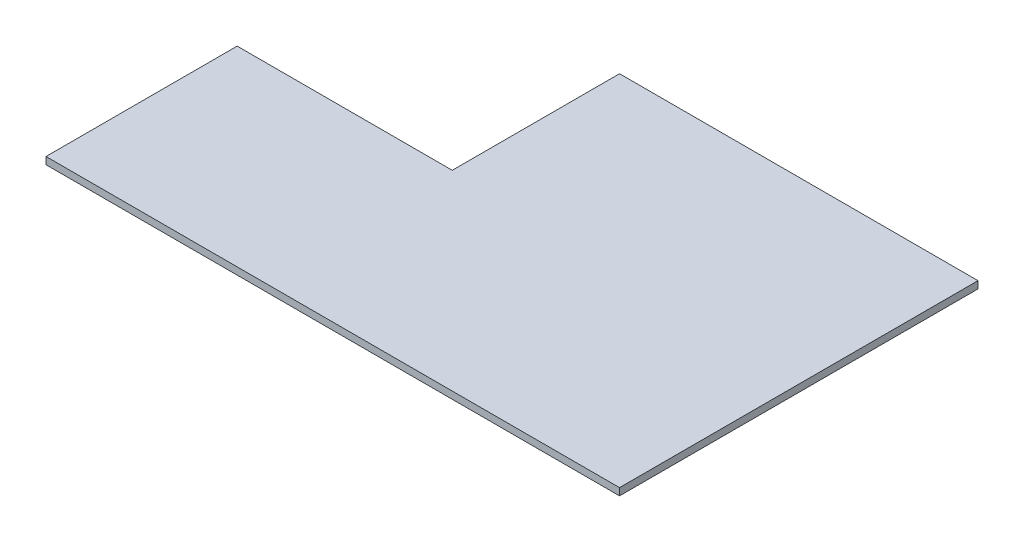
ISO-10303-21;
HEADER;
FILE_DESCRIPTION(('STEP AP214'),'2;1');
FILE_NAME('part.step','',(''),(''),'','','');
FILE_SCHEMA(('AUTOMOTIVE_DESIGN { 1 0 10303 214 1 1 1 1 }'));
ENDSEC;
DATA;
#1=APPLICATION_CONTEXT('core data for automotive mechanical design processes');
#2=APPLICATION_PROTOCOL_DEFINITION('international standard','automotive_design',2000,#1);
#3=PRODUCT_CONTEXT('',#1,'mechanical');
#4=PRODUCT('Part','Part','',(#3));
#5=PRODUCT_RELATED_PRODUCT_CATEGORY('part','',(#4));
#6=PRODUCT_DEFINITION_FORMATION('','',#4);
#7=PRODUCT_DEFINITION_CONTEXT('part definition',#1,'design');
#8=PRODUCT_DEFINITION('design','',#6,#7);
#9=PRODUCT_DEFINITION_SHAPE('','',#8);
#10=(LENGTH_UNIT() NAMED_UNIT(*) SI_UNIT(.MILLI.,.METRE.));
#11=(NAMED_UNIT(*) PLANE_ANGLE_UNIT() SI_UNIT($,.RADIAN.));
#12=(NAMED_UNIT(*) SI_UNIT($,.STERADIAN.) SOLID_ANGLE_UNIT());
#13=UNCERTAINTY_MEASURE_WITH_UNIT(LENGTH_MEASURE(1.E-05),#10,'distance_accuracy_value','');
#14=(GEOMETRIC_REPRESENTATION_CONTEXT(3) GLOBAL_UNCERTAINTY_ASSIGNED_CONTEXT((#13)) GLOBAL_UNIT_ASSIGNED_CONTEXT((#10,
#11,#12)) REPRESENTATION_CONTEXT('',''));
#15=CARTESIAN_POINT('',(0.,0.,0.));
#16=DIRECTION('',(0.,0.,1.));
#17=DIRECTION('',(1.,0.,0.));
#18=AXIS2_PLACEMENT_3D('',#15,#16,#17);
#19=CARTESIAN_POINT('',(-120.,3.,17.9310344827586));
#20=DIRECTION('',(0.,0.,-1.));
#21=DIRECTION('',(-1.,0.,0.));
#22=AXIS2_PLACEMENT_3D('',#19,#20,#21);
#23=PLANE('',#22);
#24=DIRECTION('',(1.,0.,0.));
#25=VECTOR('',#24,1.);
#26=CARTESIAN_POINT('',(-120.,0.,17.9310344827586));
#27=LINE('',#26,#25);
#28=CARTESIAN_POINT('',(-120.,0.,17.9310344827586));
#29=VERTEX_POINT('',#28);
#30=CARTESIAN_POINT('',(120.,0.,17.9310344827586));
#31=VERTEX_POINT('',#30);
#32=EDGE_CURVE('E119',#29,#31,#27,.T.);
#33=ORIENTED_EDGE('',*,*,#32,.T.);
#34=DIRECTION('',(0.,-1.,0.));
#35=VECTOR('',#34,1.);
#36=CARTESIAN_POINT('',(120.,3.,17.9310344827586));
#37=LINE('',#36,#35);
#38=CARTESIAN_POINT('',(120.,3.,17.9310344827586));
#39=VERTEX_POINT('',#38);
#40=EDGE_CURVE('E11',#39,#31,#37,.T.);
#41=ORIENTED_EDGE('',*,*,#40,.F.);
#42=DIRECTION('',(1.,0.,0.));
#43=VECTOR('',#42,1.);
#44=CARTESIAN_POINT('',(-120.,3.,17.9310344827586));
#45=LINE('',#44,#43);
#46=CARTESIAN_POINT('',(-120.,3.,17.9310344827586));
#47=VERTEX_POINT('',#46);
#48=EDGE_CURVE('E129',#47,#39,#45,.T.);
#49=ORIENTED_EDGE('',*,*,#48,.F.);
#50=DIRECTION('',(0.,-1.,0.));
#51=VECTOR('',#50,1.);
#52=CARTESIAN_POINT('',(-120.,3.,17.9310344827586));
#53=LINE('',#52,#51);
#54=EDGE_CURVE('E115',#47,#29,#53,.T.);
#55=ORIENTED_EDGE('',*,*,#54,.T.);
#56=EDGE_LOOP('',(#33,#41,#49,#55));
#57=FACE_BOUND('',#56,.T.);
#58=ADVANCED_FACE('F35',(#57),#23,.F.);
#59=CARTESIAN_POINT('',(120.,3.,-132.068965517241));
#60=DIRECTION('',(-1.,0.,0.));
#61=DIRECTION('',(0.,0.,1.));
#62=AXIS2_PLACEMENT_3D('',#59,#60,#61);
#63=PLANE('',#62);
#64=DIRECTION('',(0.,0.,-1.));
#65=VECTOR('',#64,1.);
#66=CARTESIAN_POINT('',(120.,0.,-132.068965517241));
#67=LINE('',#66,#65);
#68=CARTESIAN_POINT('',(120.,0.,-132.068965517241));
#69=VERTEX_POINT('',#68);
#70=EDGE_CURVE('E122',#31,#69,#67,.T.);
#71=ORIENTED_EDGE('',*,*,#70,.T.);
#72=DIRECTION('',(0.,-1.,0.));
#73=VECTOR('',#72,1.);
#74=CARTESIAN_POINT('',(120.,3.,-132.068965517241));
#75=LINE('',#74,#73);
#76=CARTESIAN_POINT('',(120.,3.,-132.068965517241));
#77=VERTEX_POINT('',#76);
#78=EDGE_CURVE('E43',#77,#69,#75,.T.);
#79=ORIENTED_EDGE('',*,*,#78,.F.);
#80=DIRECTION('',(0.,0.,-1.));
#81=VECTOR('',#80,1.);
#82=CARTESIAN_POINT('',(120.,3.,-132.068965517241));
#83=LINE('',#82,#81);
#84=EDGE_CURVE('E88',#39,#77,#83,.T.);
#85=ORIENTED_EDGE('',*,*,#84,.F.);
#86=ORIENTED_EDGE('',*,*,#40,.T.);
#87=EDGE_LOOP('',(#71,#79,#85,#86));
#88=FACE_BOUND('',#87,.T.);
#89=ADVANCED_FACE('F153',(#88),#63,.F.);
#90=CARTESIAN_POINT('',(120.,3.,-132.068965517241));
#91=DIRECTION('',(0.,0.,1.));
#92=DIRECTION('',(1.,0.,0.));
#93=AXIS2_PLACEMENT_3D('',#90,#91,#92);
#94=PLANE('',#93);
#95=DIRECTION('',(-1.,0.,0.));
#96=VECTOR('',#95,1.);
#97=CARTESIAN_POINT('',(120.,0.,-132.068965517241));
#98=LINE('',#97,#96);
#99=CARTESIAN_POINT('',(-30.,0.,-132.068965517241));
#100=VERTEX_POINT('',#99);
#101=EDGE_CURVE('E124',#69,#100,#98,.T.);
#102=ORIENTED_EDGE('',*,*,#101,.T.);
#103=DIRECTION('',(0.,-1.,0.));
#104=VECTOR('',#103,1.);
#105=CARTESIAN_POINT('',(-30.,3.,-132.068965517241));
#106=LINE('',#105,#104);
#107=CARTESIAN_POINT('',(-30.,3.,-132.068965517241));
#108=VERTEX_POINT('',#107);
#109=EDGE_CURVE('E110',#108,#100,#106,.T.);
#110=ORIENTED_EDGE('',*,*,#109,.F.);
#111=DIRECTION('',(-1.,0.,0.));
#112=VECTOR('',#111,1.);
#113=CARTESIAN_POINT('',(120.,3.,-132.068965517241));
#114=LINE('',#113,#112);
#115=EDGE_CURVE('E101',#77,#108,#114,.T.);
#116=ORIENTED_EDGE('',*,*,#115,.F.);
#117=ORIENTED_EDGE('',*,*,#78,.T.);
#118=EDGE_LOOP('',(#102,#110,#116,#117));
#119=FACE_BOUND('',#118,.T.);
#120=ADVANCED_FACE('F135',(#119),#94,.F.);
#121=CARTESIAN_POINT('',(-30.,3.,-62.0689655172414));
#122=DIRECTION('',(1.,0.,0.));
#123=DIRECTION('',(0.,0.,-1.));
#124=AXIS2_PLACEMENT_3D('',#121,#122,#123);
#125=PLANE('',#124);
#126=DIRECTION('',(0.,0.,1.));
#127=VECTOR('',#126,1.);
#128=CARTESIAN_POINT('',(-30.,0.,-62.0689655172414));
#129=LINE('',#128,#127);
#130=CARTESIAN_POINT('',(-30.,0.,-62.0689655172414));
#131=VERTEX_POINT('',#130);
#132=EDGE_CURVE('E109',#100,#131,#129,.T.);
#133=ORIENTED_EDGE('',*,*,#132,.T.);
#134=DIRECTION('',(0.,-1.,0.));
#135=VECTOR('',#134,1.);
#136=CARTESIAN_POINT('',(-30.,3.,-62.0689655172414));
#137=LINE('',#136,#135);
#138=CARTESIAN_POINT('',(-30.,3.,-62.0689655172414));
#139=VERTEX_POINT('',#138);
#140=EDGE_CURVE('E106',#139,#131,#137,.T.);
#141=ORIENTED_EDGE('',*,*,#140,.F.);
#142=DIRECTION('',(0.,0.,1.));
#143=VECTOR('',#142,1.);
#144=CARTESIAN_POINT('',(-30.,3.,-62.0689655172414));
#145=LINE('',#144,#143);
#146=EDGE_CURVE('E95',#108,#139,#145,.T.);
#147=ORIENTED_EDGE('',*,*,#146,.F.);
#148=ORIENTED_EDGE('',*,*,#109,.T.);
#149=EDGE_LOOP('',(#133,#141,#147,#148));
#150=FACE_BOUND('',#149,.T.);
#151=ADVANCED_FACE('F107',(#150),#125,.F.);
#152=CARTESIAN_POINT('',(-120.,3.,-62.0689655172414));
#153=DIRECTION('',(0.,0.,1.));
#154=DIRECTION('',(1.,0.,0.));
#155=AXIS2_PLACEMENT_3D('',#152,#153,#154);
#156=PLANE('',#155);
#157=DIRECTION('',(-1.,0.,0.));
#158=VECTOR('',#157,1.);
#159=CARTESIAN_POINT('',(-120.,0.,-62.0689655172414));
#160=LINE('',#159,#158);
#161=CARTESIAN_POINT('',(-120.,0.,-62.0689655172414));
#162=VERTEX_POINT('',#161);
#163=EDGE_CURVE('E74',#131,#162,#160,.T.);
#164=ORIENTED_EDGE('',*,*,#163,.T.);
#165=DIRECTION('',(0.,-1.,0.));
#166=VECTOR('',#165,1.);
#167=CARTESIAN_POINT('',(-120.,3.,-62.0689655172414));
#168=LINE('',#167,#166);
#169=CARTESIAN_POINT('',(-120.,3.,-62.0689655172414));
#170=VERTEX_POINT('',#169);
#171=EDGE_CURVE('E111',#170,#162,#168,.T.);
#172=ORIENTED_EDGE('',*,*,#171,.F.);
#173=DIRECTION('',(-1.,0.,0.));
#174=VECTOR('',#173,1.);
#175=CARTESIAN_POINT('',(-120.,3.,-62.0689655172414));
#176=LINE('',#175,#174);
#177=EDGE_CURVE('E99',#139,#170,#176,.T.);
#178=ORIENTED_EDGE('',*,*,#177,.F.);
#179=ORIENTED_EDGE('',*,*,#140,.T.);
#180=EDGE_LOOP('',(#164,#172,#178,#179));
#181=FACE_BOUND('',#180,.T.);
#182=ADVANCED_FACE('F113',(#181),#156,.F.);
#183=CARTESIAN_POINT('',(-120.,3.,-62.0689655172414));
#184=DIRECTION('',(1.,0.,0.));
#185=DIRECTION('',(0.,0.,-1.));
#186=AXIS2_PLACEMENT_3D('',#183,#184,#185);
#187=PLANE('',#186);
#188=DIRECTION('',(0.,0.,1.));
#189=VECTOR('',#188,1.);
#190=CARTESIAN_POINT('',(-120.,0.,-62.0689655172414));
#191=LINE('',#190,#189);
#192=EDGE_CURVE('E80',#162,#29,#191,.T.);
#193=ORIENTED_EDGE('',*,*,#192,.T.);
#194=ORIENTED_EDGE('',*,*,#54,.F.);
#195=DIRECTION('',(0.,0.,1.));
#196=VECTOR('',#195,1.);
#197=CARTESIAN_POINT('',(-120.,3.,-62.0689655172414));
#198=LINE('',#197,#196);
#199=EDGE_CURVE('E51',#170,#47,#198,.T.);
#200=ORIENTED_EDGE('',*,*,#199,.F.);
#201=ORIENTED_EDGE('',*,*,#171,.T.);
#202=EDGE_LOOP('',(#193,#194,#200,#201));
#203=FACE_BOUND('',#202,.T.);
#204=ADVANCED_FACE('F142',(#203),#187,.F.);
#205=CARTESIAN_POINT('',(0.,3.,0.));
#206=DIRECTION('',(0.,-1.,0.));
#207=DIRECTION('',(0.,0.,-1.));
#208=AXIS2_PLACEMENT_3D('',#205,#206,#207);
#209=PLANE('',#208);
#210=ORIENTED_EDGE('',*,*,#48,.T.);
#211=ORIENTED_EDGE('',*,*,#84,.T.);
#212=ORIENTED_EDGE('',*,*,#115,.T.);
#213=ORIENTED_EDGE('',*,*,#146,.T.);
#214=ORIENTED_EDGE('',*,*,#177,.T.);
#215=ORIENTED_EDGE('',*,*,#199,.T.);
#216=EDGE_LOOP('',(#210,#211,#212,#213,#214,#215));
#217=FACE_BOUND('',#216,.T.);
#218=ADVANCED_FACE('F97',(#217),#209,.F.);
#219=CARTESIAN_POINT('',(0.,0.,0.));
#220=DIRECTION('',(0.,-1.,0.));
#221=DIRECTION('',(0.,0.,-1.));
#222=AXIS2_PLACEMENT_3D('',#219,#220,#221);
#223=PLANE('',#222);
#224=ORIENTED_EDGE('',*,*,#32,.F.);
#225=ORIENTED_EDGE('',*,*,#192,.F.);
#226=ORIENTED_EDGE('',*,*,#163,.F.);
#227=ORIENTED_EDGE('',*,*,#132,.F.);
#228=ORIENTED_EDGE('',*,*,#101,.F.);
#229=ORIENTED_EDGE('',*,*,#70,.F.);
#230=EDGE_LOOP('',(#224,#225,#226,#227,#228,#229));
#231=FACE_BOUND('',#230,.T.);
#232=ADVANCED_FACE('F138',(#231),#223,.T.);
#233=CLOSED_SHELL('',(#58,#89,#120,#151,#182,#204,#218,#232));
#234=MANIFOLD_SOLID_BREP('B2',#233);
#235=ADVANCED_BREP_SHAPE_REPRESENTATION('',(#18,#234),#14);
#236=SHAPE_DEFINITION_REPRESENTATION(#9,#235);
ENDSEC;
END-ISO-10303-21;
